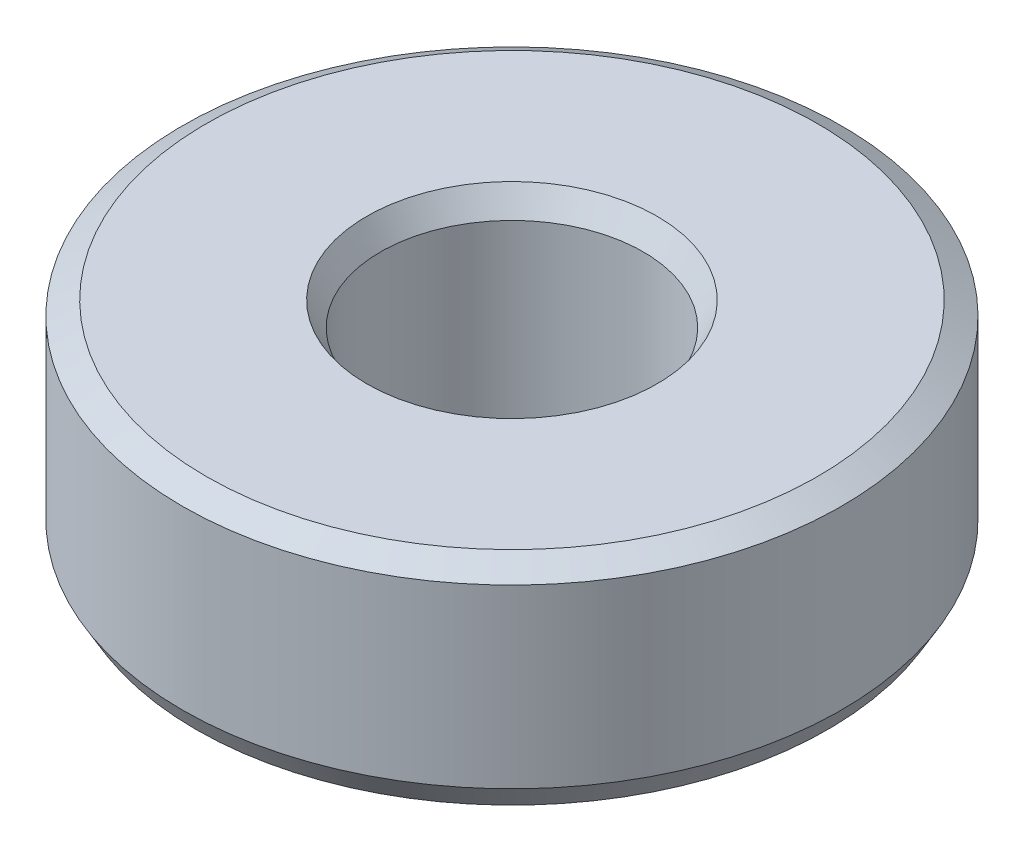
ISO-10303-21;
HEADER;
FILE_DESCRIPTION(('STEP AP214'),'2;1');
FILE_NAME('part.step','',(''),(''),'','','');
FILE_SCHEMA(('AUTOMOTIVE_DESIGN { 1 0 10303 214 1 1 1 1 }'));
ENDSEC;
DATA;
#1=APPLICATION_CONTEXT('core data for automotive mechanical design processes');
#2=APPLICATION_PROTOCOL_DEFINITION('international standard','automotive_design',2000,#1);
#3=PRODUCT_CONTEXT('',#1,'mechanical');
#4=PRODUCT('Part','Part','',(#3));
#5=PRODUCT_RELATED_PRODUCT_CATEGORY('part','',(#4));
#6=PRODUCT_DEFINITION_FORMATION('','',#4);
#7=PRODUCT_DEFINITION_CONTEXT('part definition',#1,'design');
#8=PRODUCT_DEFINITION('design','',#6,#7);
#9=PRODUCT_DEFINITION_SHAPE('','',#8);
#10=(LENGTH_UNIT() NAMED_UNIT(*) SI_UNIT(.MILLI.,.METRE.));
#11=(NAMED_UNIT(*) PLANE_ANGLE_UNIT() SI_UNIT($,.RADIAN.));
#12=(NAMED_UNIT(*) SI_UNIT($,.STERADIAN.) SOLID_ANGLE_UNIT());
#13=UNCERTAINTY_MEASURE_WITH_UNIT(LENGTH_MEASURE(1.E-05),#10,'distance_accuracy_value','');
#14=(GEOMETRIC_REPRESENTATION_CONTEXT(3) GLOBAL_UNCERTAINTY_ASSIGNED_CONTEXT((#13)) GLOBAL_UNIT_ASSIGNED_CONTEXT((#10,
#11,#12)) REPRESENTATION_CONTEXT('',''));
#15=CARTESIAN_POINT('',(0.,0.,0.));
#16=DIRECTION('',(0.,0.,1.));
#17=DIRECTION('',(1.,0.,0.));
#18=AXIS2_PLACEMENT_3D('',#15,#16,#17);
#19=CARTESIAN_POINT('',(0.,24.3680913030091,0.));
#20=DIRECTION('',(0.,-1.,0.));
#21=DIRECTION('',(0.,0.,-1.));
#22=AXIS2_PLACEMENT_3D('',#19,#20,#21);
#23=CYLINDRICAL_SURFACE('',#22,37.5);
#24=CARTESIAN_POINT('',(0.,2.72064412836519,0.));
#25=DIRECTION('',(0.,1.,0.));
#26=DIRECTION('',(0.,0.,1.));
#27=AXIS2_PLACEMENT_3D('',#24,#25,#26);
#28=CIRCLE('',#27,37.5);
#29=CARTESIAN_POINT('',(0.,2.72064412836519,37.5));
#30=VERTEX_POINT('',#29);
#31=EDGE_CURVE('E10',#30,#30,#28,.T.);
#32=ORIENTED_EDGE('',*,*,#31,.T.);
#33=EDGE_LOOP('',(#32));
#34=FACE_BOUND('',#33,.T.);
#35=CARTESIAN_POINT('',(0.,22.7973266831282,0.));
#36=DIRECTION('',(0.,1.,0.));
#37=DIRECTION('',(0.,0.,1.));
#38=AXIS2_PLACEMENT_3D('',#35,#36,#37);
#39=CIRCLE('',#38,37.5);
#40=CARTESIAN_POINT('',(0.,22.7973266831282,37.5));
#41=VERTEX_POINT('',#40);
#42=EDGE_CURVE('E50',#41,#41,#39,.F.);
#43=ORIENTED_EDGE('',*,*,#42,.T.);
#44=EDGE_LOOP('',(#43));
#45=FACE_BOUND('',#44,.T.);
#46=ADVANCED_FACE('F39',(#34,#45),#23,.T.);
#47=CARTESIAN_POINT('',(0.,24.3680913030091,0.));
#48=DIRECTION('',(0.,1.,0.));
#49=DIRECTION('',(0.,0.,1.));
#50=AXIS2_PLACEMENT_3D('',#47,#48,#49);
#51=PLANE('',#50);
#52=CARTESIAN_POINT('',(0.,24.3680913030091,0.));
#53=DIRECTION('',(0.,1.,0.));
#54=DIRECTION('',(0.,0.,1.));
#55=AXIS2_PLACEMENT_3D('',#52,#53,#54);
#56=CIRCLE('',#55,16.5214829955565);
#57=CARTESIAN_POINT('',(0.,24.3680913030091,16.5214829955565));
#58=VERTEX_POINT('',#57);
#59=EDGE_CURVE('E58',#58,#58,#56,.F.);
#60=ORIENTED_EDGE('',*,*,#59,.T.);
#61=EDGE_LOOP('',(#60));
#62=FACE_BOUND('',#61,.T.);
#63=CARTESIAN_POINT('',(0.,24.3680913030091,0.));
#64=DIRECTION('',(0.,1.,0.));
#65=DIRECTION('',(0.,0.,1.));
#66=AXIS2_PLACEMENT_3D('',#63,#64,#65);
#67=CIRCLE('',#66,34.7793558716348);
#68=CARTESIAN_POINT('',(0.,24.3680913030091,34.7793558716348));
#69=VERTEX_POINT('',#68);
#70=EDGE_CURVE('E61',#69,#69,#67,.T.);
#71=ORIENTED_EDGE('',*,*,#70,.T.);
#72=EDGE_LOOP('',(#71));
#73=FACE_BOUND('',#72,.T.);
#74=ADVANCED_FACE('F88',(#62,#73),#51,.T.);
#75=CARTESIAN_POINT('',(0.,0.,0.));
#76=DIRECTION('',(0.,1.,0.));
#77=DIRECTION('',(0.,0.,1.));
#78=AXIS2_PLACEMENT_3D('',#75,#76,#77);
#79=PLANE('',#78);
#80=CARTESIAN_POINT('',(0.,0.,0.));
#81=DIRECTION('',(0.,1.,0.));
#82=DIRECTION('',(0.,0.,1.));
#83=AXIS2_PLACEMENT_3D('',#80,#81,#82);
#84=CIRCLE('',#83,17.6713625040409);
#85=CARTESIAN_POINT('',(0.,0.,17.6713625040409));
#86=VERTEX_POINT('',#85);
#87=EDGE_CURVE('E51',#86,#86,#84,.T.);
#88=ORIENTED_EDGE('',*,*,#87,.T.);
#89=EDGE_LOOP('',(#88));
#90=FACE_BOUND('',#89,.T.);
#91=CARTESIAN_POINT('',(0.,0.,0.));
#92=DIRECTION('',(0.,1.,0.));
#93=DIRECTION('',(0.,0.,1.));
#94=AXIS2_PLACEMENT_3D('',#91,#92,#93);
#95=CIRCLE('',#94,35.9292353801192);
#96=CARTESIAN_POINT('',(0.,0.,35.9292353801192));
#97=VERTEX_POINT('',#96);
#98=EDGE_CURVE('E54',#97,#97,#95,.F.);
#99=ORIENTED_EDGE('',*,*,#98,.T.);
#100=EDGE_LOOP('',(#99));
#101=FACE_BOUND('',#100,.T.);
#102=ADVANCED_FACE('F83',(#90,#101),#79,.F.);
#103=CARTESIAN_POINT('',(0.,24.3680913030091,0.));
#104=DIRECTION('',(0.,-1.,0.));
#105=DIRECTION('',(0.,0.,-1.));
#106=AXIS2_PLACEMENT_3D('',#103,#104,#105);
#107=CYLINDRICAL_SURFACE('',#106,14.9507183756757);
#108=CARTESIAN_POINT('',(0.,21.6474471746439,0.));
#109=DIRECTION('',(0.,1.,0.));
#110=DIRECTION('',(0.,0.,1.));
#111=AXIS2_PLACEMENT_3D('',#108,#109,#110);
#112=CIRCLE('',#111,14.9507183756757);
#113=CARTESIAN_POINT('',(0.,21.6474471746439,14.9507183756757));
#114=VERTEX_POINT('',#113);
#115=EDGE_CURVE('E67',#114,#114,#112,.T.);
#116=ORIENTED_EDGE('',*,*,#115,.T.);
#117=EDGE_LOOP('',(#116));
#118=FACE_BOUND('',#117,.T.);
#119=CARTESIAN_POINT('',(0.,1.57076461988083,0.));
#120=DIRECTION('',(0.,1.,0.));
#121=DIRECTION('',(0.,0.,1.));
#122=AXIS2_PLACEMENT_3D('',#119,#120,#121);
#123=CIRCLE('',#122,14.9507183756757);
#124=CARTESIAN_POINT('',(0.,1.57076461988083,14.9507183756757));
#125=VERTEX_POINT('',#124);
#126=EDGE_CURVE('E69',#125,#125,#123,.F.);
#127=ORIENTED_EDGE('',*,*,#126,.T.);
#128=EDGE_LOOP('',(#127));
#129=FACE_BOUND('',#128,.T.);
#130=ADVANCED_FACE('F71',(#118,#129),#107,.F.);
#131=CARTESIAN_POINT('',(0.,21.6474471746439,0.));
#132=DIRECTION('',(0.,1.,0.));
#133=DIRECTION('',(0.,0.,1.));
#134=AXIS2_PLACEMENT_3D('',#131,#132,#133);
#135=CONICAL_SURFACE('',#134,14.9507183756757,0.523598775598304);
#136=CARTESIAN_POINT('',(0.,24.3680913030091,16.5214829955565));
#137=CARTESIAN_POINT('',(0.,24.3397512600053,16.5051208640994));
#138=CARTESIAN_POINT('',(0.,24.3114112170015,16.4887587326423));
#139=CARTESIAN_POINT('',(0.,24.2547311309939,16.4560344697282));
#140=CARTESIAN_POINT('',(0.,24.22639108799,16.4396723382711));
#141=CARTESIAN_POINT('',(0.,24.1697110019824,16.4069480753569));
#142=CARTESIAN_POINT('',(0.,24.1413709589786,16.3905859438998));
#143=CARTESIAN_POINT('',(0.,24.084690872971,16.3578616809856));
#144=CARTESIAN_POINT('',(0.,24.0563508299672,16.3414995495285));
#145=CARTESIAN_POINT('',(0.,23.9996707439596,16.3087752866143));
#146=CARTESIAN_POINT('',(0.,23.9713307009558,16.2924131551572));
#147=CARTESIAN_POINT('',(0.,23.9146506149482,16.259688892243));
#148=CARTESIAN_POINT('',(0.,23.8863105719444,16.243326760786));
#149=CARTESIAN_POINT('',(0.,23.8296304859368,16.2106024978718));
#150=CARTESIAN_POINT('',(0.,23.801290442933,16.1942403664147));
#151=CARTESIAN_POINT('',(0.,23.7446103569254,16.1615161035005));
#152=CARTESIAN_POINT('',(0.,23.7162703139216,16.1451539720434));
#153=CARTESIAN_POINT('',(0.,23.659590227914,16.1124297091292));
#154=CARTESIAN_POINT('',(0.,23.6312501849102,16.0960675776721));
#155=CARTESIAN_POINT('',(0.,23.5745700989025,16.0633433147579));
#156=CARTESIAN_POINT('',(0.,23.5462300558987,16.0469811833009));
#157=CARTESIAN_POINT('',(0.,23.4895499698911,16.0142569203867));
#158=CARTESIAN_POINT('',(0.,23.4612099268873,15.9978947889296));
#159=CARTESIAN_POINT('',(0.,23.4045298408797,15.9651705260154));
#160=CARTESIAN_POINT('',(0.,23.3761897978759,15.9488083945583));
#161=CARTESIAN_POINT('',(0.,23.3195097118683,15.9160841316441));
#162=CARTESIAN_POINT('',(0.,23.2911696688645,15.899722000187));
#163=CARTESIAN_POINT('',(0.,23.2344895828569,15.8669977372728));
#164=CARTESIAN_POINT('',(0.,23.2061495398531,15.8506356058157));
#165=CARTESIAN_POINT('',(0.,23.1494694538455,15.8179113429016));
#166=CARTESIAN_POINT('',(0.,23.1211294108417,15.8015492114445));
#167=CARTESIAN_POINT('',(0.,23.0644493248341,15.7688249485303));
#168=CARTESIAN_POINT('',(0.,23.0361092818303,15.7524628170732));
#169=CARTESIAN_POINT('',(0.,22.9794291958227,15.719738554159));
#170=CARTESIAN_POINT('',(0.,22.9510891528189,15.7033764227019));
#171=CARTESIAN_POINT('',(0.,22.8944090668113,15.6706521597877));
#172=CARTESIAN_POINT('',(0.,22.8660690238074,15.6542900283306));
#173=CARTESIAN_POINT('',(0.,22.8093889377998,15.6215657654165));
#174=CARTESIAN_POINT('',(0.,22.781048894796,15.6052036339594));
#175=CARTESIAN_POINT('',(0.,22.7243688087884,15.5724793710452));
#176=CARTESIAN_POINT('',(0.,22.6960287657846,15.5561172395881));
#177=CARTESIAN_POINT('',(0.,22.639348679777,15.5233929766739));
#178=CARTESIAN_POINT('',(0.,22.6110086367732,15.5070308452168));
#179=CARTESIAN_POINT('',(0.,22.5543285507656,15.4743065823026));
#180=CARTESIAN_POINT('',(0.,22.5259885077618,15.4579444508455));
#181=CARTESIAN_POINT('',(0.,22.4693084217542,15.4252201879314));
#182=CARTESIAN_POINT('',(0.,22.4409683787504,15.4088580564743));
#183=CARTESIAN_POINT('',(0.,22.3842882927428,15.3761337935601));
#184=CARTESIAN_POINT('',(0.,22.355948249739,15.359771662103));
#185=CARTESIAN_POINT('',(0.,22.2992681637314,15.3270473991888));
#186=CARTESIAN_POINT('',(0.,22.2709281207276,15.3106852677317));
#187=CARTESIAN_POINT('',(0.,22.21424803472,15.2779610048175));
#188=CARTESIAN_POINT('',(0.,22.1859079917161,15.2615988733604));
#189=CARTESIAN_POINT('',(0.,22.1292279057085,15.2288746104462));
#190=CARTESIAN_POINT('',(0.,22.1008878627047,15.2125124789892));
#191=CARTESIAN_POINT('',(0.,22.0442077766971,15.179788216075));
#192=CARTESIAN_POINT('',(0.,22.0158677336933,15.1634260846179));
#193=CARTESIAN_POINT('',(0.,21.9591876476857,15.1307018217037));
#194=CARTESIAN_POINT('',(0.,21.9308476046819,15.1143396902466));
#195=CARTESIAN_POINT('',(0.,21.8741675186743,15.0816154273324));
#196=CARTESIAN_POINT('',(0.,21.8458274756705,15.0652532958753));
#197=CARTESIAN_POINT('',(0.,21.7891473896629,15.0325290329611));
#198=CARTESIAN_POINT('',(0.,21.7608073466591,15.0161669015041));
#199=CARTESIAN_POINT('',(0.,21.7041272606515,14.9834426385899));
#200=CARTESIAN_POINT('',(0.,21.6757872176477,14.9670805071328));
#201=CARTESIAN_POINT('',(0.,21.6474471746439,14.9507183756757));
#202=B_SPLINE_CURVE_WITH_KNOTS('',3,(#136,#137,#138,#139,#140,#141,#142,#143,#144,#145,#146,
#147,#148,#149,#150,#151,#152,#153,#154,#155,#156,#157,#158,#159,#160,#161,#162,#163,#164,#165,
#166,#167,#168,#169,#170,#171,#172,#173,#174,#175,#176,#177,#178,#179,#180,#181,#182,#183,#184,
#185,#186,#187,#188,#189,#190,#191,#192,#193,#194,#195,#196,#197,#198,#199,#200,#201),
.UNSPECIFIED.,.F.,.F.,(4,2,2,2,2,2,2,2,2,2,2,2,2,2,2,2,2,2,2,2,2,2,2,2,2,2,2,2,2,2,2,2,4),(0.,
0.0981727887425529,0.196345577485104,0.294518366227657,0.392691154970207,0.49086394371276,
0.589036732455312,0.687209521197865,0.785382309940415,0.883555098682967,0.981727887425517,
1.07990067616807,1.17807346491062,1.27624625365317,1.37441904239572,1.47259183113827,
1.57076461988083,1.66893740862338,1.76711019736593,1.86528298610848,1.96345577485104,
2.06162856359359,2.15980135233614,2.25797414107869,2.35614692982124,2.45431971856379,
2.55249250730635,2.65066529604889,2.74883808479145,2.847010873534,2.94518366227655,
3.0433564510191,3.14152923976165),.UNSPECIFIED.);
#203=EDGE_CURVE('BSEAM77',#58,#114,#202,.T.);
#204=ORIENTED_EDGE('',*,*,#59,.F.);
#205=ORIENTED_EDGE('',*,*,#115,.F.);
#206=ORIENTED_EDGE('',*,*,#203,.T.);
#207=ORIENTED_EDGE('',*,*,#203,.F.);
#208=EDGE_LOOP('',(#204,#206,#205,#207));
#209=FACE_BOUND('',#208,.T.);
#210=ADVANCED_FACE('F77',(#209),#135,.F.);
#211=CARTESIAN_POINT('',(0.,0.,0.));
#212=DIRECTION('',(0.,-1.,0.));
#213=DIRECTION('',(0.,0.,-1.));
#214=AXIS2_PLACEMENT_3D('',#211,#212,#213);
#215=CONICAL_SURFACE('',#214,17.6713625040409,1.0471975511966);
#216=ORIENTED_EDGE('',*,*,#126,.F.);
#217=EDGE_LOOP('',(#216));
#218=FACE_BOUND('',#217,.T.);
#219=ORIENTED_EDGE('',*,*,#87,.F.);
#220=EDGE_LOOP('',(#219));
#221=FACE_BOUND('',#220,.T.);
#222=ADVANCED_FACE('F73',(#218,#221),#215,.F.);
#223=CARTESIAN_POINT('',(0.,2.72064412836519,0.));
#224=DIRECTION('',(0.,1.,0.));
#225=DIRECTION('',(0.,0.,1.));
#226=AXIS2_PLACEMENT_3D('',#223,#224,#225);
#227=CONICAL_SURFACE('',#226,37.5,0.523598775598303);
#228=ORIENTED_EDGE('',*,*,#98,.F.);
#229=EDGE_LOOP('',(#228));
#230=FACE_BOUND('',#229,.T.);
#231=ORIENTED_EDGE('',*,*,#31,.F.);
#232=EDGE_LOOP('',(#231));
#233=FACE_BOUND('',#232,.T.);
#234=ADVANCED_FACE('F76',(#230,#233),#227,.T.);
#235=CARTESIAN_POINT('',(0.,24.3680913030091,0.));
#236=DIRECTION('',(0.,-1.,0.));
#237=DIRECTION('',(0.,0.,-1.));
#238=AXIS2_PLACEMENT_3D('',#235,#236,#237);
#239=CONICAL_SURFACE('',#238,34.7793558716348,1.04719755119659);
#240=ORIENTED_EDGE('',*,*,#42,.F.);
#241=EDGE_LOOP('',(#240));
#242=FACE_BOUND('',#241,.T.);
#243=ORIENTED_EDGE('',*,*,#70,.F.);
#244=EDGE_LOOP('',(#243));
#245=FACE_BOUND('',#244,.T.);
#246=ADVANCED_FACE('F45',(#242,#245),#239,.T.);
#247=CLOSED_SHELL('',(#46,#74,#102,#130,#210,#222,#234,#246));
#248=MANIFOLD_SOLID_BREP('B2',#247);
#249=ADVANCED_BREP_SHAPE_REPRESENTATION('',(#18,#248),#14);
#250=SHAPE_DEFINITION_REPRESENTATION(#9,#249);
ENDSEC;
END-ISO-10303-21;
